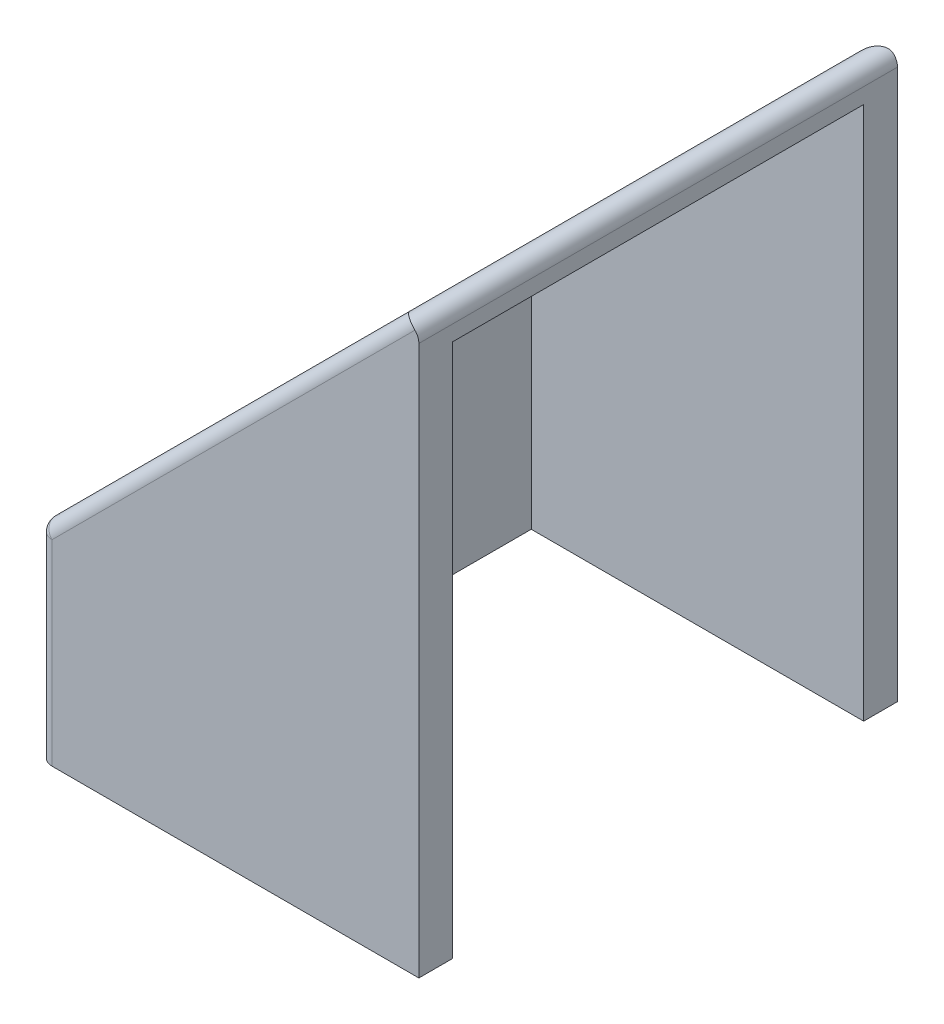
ISO-10303-21;
HEADER;
FILE_DESCRIPTION(('STEP AP214'),'2;1');
FILE_NAME('part.step','',(''),(''),'','','');
FILE_SCHEMA(('AUTOMOTIVE_DESIGN { 1 0 10303 214 1 1 1 1 }'));
ENDSEC;
DATA;
#1=APPLICATION_CONTEXT('core data for automotive mechanical design processes');
#2=APPLICATION_PROTOCOL_DEFINITION('international standard','automotive_design',2000,#1);
#3=PRODUCT_CONTEXT('',#1,'mechanical');
#4=PRODUCT('Part','Part','',(#3));
#5=PRODUCT_RELATED_PRODUCT_CATEGORY('part','',(#4));
#6=PRODUCT_DEFINITION_FORMATION('','',#4);
#7=PRODUCT_DEFINITION_CONTEXT('part definition',#1,'design');
#8=PRODUCT_DEFINITION('design','',#6,#7);
#9=PRODUCT_DEFINITION_SHAPE('','',#8);
#10=(LENGTH_UNIT() NAMED_UNIT(*) SI_UNIT(.MILLI.,.METRE.));
#11=(NAMED_UNIT(*) PLANE_ANGLE_UNIT() SI_UNIT($,.RADIAN.));
#12=(NAMED_UNIT(*) SI_UNIT($,.STERADIAN.) SOLID_ANGLE_UNIT());
#13=UNCERTAINTY_MEASURE_WITH_UNIT(LENGTH_MEASURE(1.E-05),#10,'distance_accuracy_value','');
#14=(GEOMETRIC_REPRESENTATION_CONTEXT(3) GLOBAL_UNCERTAINTY_ASSIGNED_CONTEXT((#13)) GLOBAL_UNIT_ASSIGNED_CONTEXT((#10,
#11,#12)) REPRESENTATION_CONTEXT('',''));
#15=CARTESIAN_POINT('',(0.,0.,0.));
#16=DIRECTION('',(0.,0.,1.));
#17=DIRECTION('',(1.,0.,0.));
#18=AXIS2_PLACEMENT_3D('',#15,#16,#17);
#19=CARTESIAN_POINT('',(17.9605122421382,17.9605122421384,22.606));
#20=DIRECTION('',(-1.,0.,0.));
#21=DIRECTION('',(0.,-1.,0.));
#22=AXIS2_PLACEMENT_3D('',#19,#20,#21);
#23=PLANE('',#22);
#24=DIRECTION('',(0.,1.,0.));
#25=VECTOR('',#24,1.);
#26=CARTESIAN_POINT('',(17.9605122421382,17.9605122421384,0.));
#27=LINE('',#26,#25);
#28=CARTESIAN_POINT('',(17.9605122421382,-9.525,0.));
#29=VERTEX_POINT('',#28);
#30=CARTESIAN_POINT('',(17.9605122421382,16.4274866300315,0.));
#31=VERTEX_POINT('',#30);
#32=EDGE_CURVE('E141',#29,#31,#27,.T.);
#33=ORIENTED_EDGE('',*,*,#32,.T.);
#34=DIRECTION('',(0.,0.,-1.));
#35=VECTOR('',#34,1.);
#36=CARTESIAN_POINT('',(17.9605122421382,16.4274866300315,22.606));
#37=LINE('',#36,#35);
#38=CARTESIAN_POINT('',(17.9605122421382,16.4274866300315,22.606));
#39=VERTEX_POINT('',#38);
#40=EDGE_CURVE('E12',#31,#39,#37,.F.);
#41=ORIENTED_EDGE('',*,*,#40,.T.);
#42=DIRECTION('',(0.,1.,0.));
#43=VECTOR('',#42,1.);
#44=CARTESIAN_POINT('',(17.9605122421382,17.9605122421384,22.606));
#45=LINE('',#44,#43);
#46=CARTESIAN_POINT('',(17.9605122421382,-9.525,22.606));
#47=VERTEX_POINT('',#46);
#48=EDGE_CURVE('E131',#47,#39,#45,.T.);
#49=ORIENTED_EDGE('',*,*,#48,.F.);
#50=DIRECTION('',(0.,0.,1.));
#51=VECTOR('',#50,1.);
#52=CARTESIAN_POINT('',(17.9605122421382,-9.525,21.006));
#53=LINE('',#52,#51);
#54=CARTESIAN_POINT('',(17.9605122421382,-9.525,21.006));
#55=VERTEX_POINT('',#54);
#56=EDGE_CURVE('E136',#55,#47,#53,.T.);
#57=ORIENTED_EDGE('',*,*,#56,.F.);
#58=DIRECTION('',(0.,-1.,0.));
#59=VECTOR('',#58,1.);
#60=CARTESIAN_POINT('',(17.9605122421382,16.3605122421384,21.006));
#61=LINE('',#60,#59);
#62=CARTESIAN_POINT('',(17.9605122421382,15.6977705423414,21.006));
#63=VERTEX_POINT('',#62);
#64=EDGE_CURVE('E181',#63,#55,#61,.T.);
#65=ORIENTED_EDGE('',*,*,#64,.F.);
#66=DIRECTION('',(0.,0.,-1.));
#67=VECTOR('',#66,1.);
#68=CARTESIAN_POINT('',(17.9605122421382,15.6977705423414,0.));
#69=LINE('',#68,#67);
#70=CARTESIAN_POINT('',(17.9605122421382,15.6977705423414,1.6));
#71=VERTEX_POINT('',#70);
#72=EDGE_CURVE('E186',#63,#71,#69,.T.);
#73=ORIENTED_EDGE('',*,*,#72,.T.);
#74=DIRECTION('',(0.,1.,0.));
#75=VECTOR('',#74,1.);
#76=CARTESIAN_POINT('',(17.9605122421382,0.,1.6));
#77=LINE('',#76,#75);
#78=CARTESIAN_POINT('',(17.9605122421382,-9.525,1.6));
#79=VERTEX_POINT('',#78);
#80=EDGE_CURVE('E177',#79,#71,#77,.T.);
#81=ORIENTED_EDGE('',*,*,#80,.F.);
#82=DIRECTION('',(0.,0.,1.));
#83=VECTOR('',#82,1.);
#84=CARTESIAN_POINT('',(17.9605122421382,-9.525,0.));
#85=LINE('',#84,#83);
#86=EDGE_CURVE('E164',#29,#79,#85,.T.);
#87=ORIENTED_EDGE('',*,*,#86,.F.);
#88=EDGE_LOOP('',(#33,#41,#49,#57,#65,#73,#81,#87));
#89=FACE_BOUND('',#88,.T.);
#90=ADVANCED_FACE('F36',(#89),#23,.F.);
#91=CARTESIAN_POINT('',(0.,0.,22.606));
#92=DIRECTION('',(0.707106781186551,-0.707106781186543,0.));
#93=DIRECTION('',(0.707106781186543,0.707106781186552,0.));
#94=AXIS2_PLACEMENT_3D('',#91,#92,#93);
#95=PLANE('',#94);
#96=DIRECTION('',(0.,0.,-1.));
#97=VECTOR('',#96,1.);
#98=CARTESIAN_POINT('',(16.8764994360847,16.8764994360849,22.606));
#99=LINE('',#98,#97);
#100=CARTESIAN_POINT('',(16.8764994360847,16.8764994360849,21.971));
#101=VERTEX_POINT('',#100);
#102=CARTESIAN_POINT('',(16.8764994360847,16.8764994360849,0.635));
#103=VERTEX_POINT('',#102);
#104=EDGE_CURVE('E217',#101,#103,#99,.T.);
#105=ORIENTED_EDGE('',*,*,#104,.T.);
#106=DIRECTION('',(-0.707106781186543,-0.707106781186552,0.));
#107=VECTOR('',#106,1.);
#108=CARTESIAN_POINT('',(0.,0.,0.635));
#109=LINE('',#108,#107);
#110=CARTESIAN_POINT('',(0.18598719394654,0.185987193946542,0.635));
#111=VERTEX_POINT('',#110);
#112=EDGE_CURVE('E45',#103,#111,#109,.T.);
#113=ORIENTED_EDGE('',*,*,#112,.T.);
#114=DIRECTION('',(0.,0.,-1.));
#115=VECTOR('',#114,1.);
#116=CARTESIAN_POINT('',(0.18598719394654,0.185987193946542,22.606));
#117=LINE('',#116,#115);
#118=CARTESIAN_POINT('',(0.18598719394654,0.185987193946542,21.971));
#119=VERTEX_POINT('',#118);
#120=EDGE_CURVE('E215',#111,#119,#117,.F.);
#121=ORIENTED_EDGE('',*,*,#120,.T.);
#122=DIRECTION('',(-0.707106781186543,-0.707106781186552,0.));
#123=VECTOR('',#122,1.);
#124=CARTESIAN_POINT('',(17.9605122421382,17.9605122421384,21.971));
#125=LINE('',#124,#123);
#126=EDGE_CURVE('E213',#119,#101,#125,.F.);
#127=ORIENTED_EDGE('',*,*,#126,.T.);
#128=EDGE_LOOP('',(#105,#113,#121,#127));
#129=FACE_BOUND('',#128,.T.);
#130=ADVANCED_FACE('F293',(#129),#95,.F.);
#131=CARTESIAN_POINT('',(0.,0.,22.606));
#132=DIRECTION('',(0.,0.,1.));
#133=DIRECTION('',(1.,0.,0.));
#134=AXIS2_PLACEMENT_3D('',#131,#132,#133);
#135=PLANE('',#134);
#136=DIRECTION('',(-0.707106781186543,-0.707106781186552,0.));
#137=VECTOR('',#136,1.);
#138=CARTESIAN_POINT('',(0.44901280605346,-0.449012806053455,22.606));
#139=LINE('',#138,#137);
#140=CARTESIAN_POINT('',(17.7745250481917,16.8764994360849,22.606));
#141=VERTEX_POINT('',#140);
#142=CARTESIAN_POINT('',(0.635,-0.263025612106913,22.606));
#143=VERTEX_POINT('',#142);
#144=EDGE_CURVE('E208',#141,#143,#139,.T.);
#145=ORIENTED_EDGE('',*,*,#144,.T.);
#146=DIRECTION('',(0.,1.,0.));
#147=VECTOR('',#146,1.);
#148=CARTESIAN_POINT('',(0.635,-9.525,22.606));
#149=LINE('',#148,#147);
#150=CARTESIAN_POINT('',(0.635,-9.525,22.606));
#151=VERTEX_POINT('',#150);
#152=EDGE_CURVE('E147',#143,#151,#149,.F.);
#153=ORIENTED_EDGE('',*,*,#152,.T.);
#154=DIRECTION('',(-1.,0.,0.));
#155=VECTOR('',#154,1.);
#156=CARTESIAN_POINT('',(17.9605122421382,-9.525,22.606));
#157=LINE('',#156,#155);
#158=EDGE_CURVE('E144',#47,#151,#157,.T.);
#159=ORIENTED_EDGE('',*,*,#158,.F.);
#160=ORIENTED_EDGE('',*,*,#48,.T.);
#161=CARTESIAN_POINT('',(17.3255122421382,16.4274866300315,22.606));
#162=DIRECTION('',(0.,0.,1.));
#163=DIRECTION('',(1.,0.,0.));
#164=AXIS2_PLACEMENT_3D('',#161,#162,#163);
#165=CIRCLE('',#164,0.635);
#166=EDGE_CURVE('E210',#39,#141,#165,.T.);
#167=ORIENTED_EDGE('',*,*,#166,.T.);
#168=EDGE_LOOP('',(#145,#153,#159,#160,#167));
#169=FACE_BOUND('',#168,.T.);
#170=ADVANCED_FACE('F145',(#169),#135,.T.);
#171=CARTESIAN_POINT('',(0.,0.,0.));
#172=DIRECTION('',(0.,0.,1.));
#173=DIRECTION('',(1.,0.,0.));
#174=AXIS2_PLACEMENT_3D('',#171,#172,#173);
#175=PLANE('',#174);
#176=DIRECTION('',(1.,0.,0.));
#177=VECTOR('',#176,1.);
#178=CARTESIAN_POINT('',(0.,-9.525,0.));
#179=LINE('',#178,#177);
#180=CARTESIAN_POINT('',(0.635,-9.525,0.));
#181=VERTEX_POINT('',#180);
#182=EDGE_CURVE('E162',#181,#29,#179,.T.);
#183=ORIENTED_EDGE('',*,*,#182,.F.);
#184=DIRECTION('',(0.,1.,0.));
#185=VECTOR('',#184,1.);
#186=CARTESIAN_POINT('',(0.635,0.,0.));
#187=LINE('',#186,#185);
#188=CARTESIAN_POINT('',(0.635,-0.263025612106911,0.));
#189=VERTEX_POINT('',#188);
#190=EDGE_CURVE('E195',#181,#189,#187,.T.);
#191=ORIENTED_EDGE('',*,*,#190,.T.);
#192=DIRECTION('',(-0.707106781186543,-0.707106781186552,0.));
#193=VECTOR('',#192,1.);
#194=CARTESIAN_POINT('',(0.44901280605346,-0.449012806053455,0.));
#195=LINE('',#194,#193);
#196=CARTESIAN_POINT('',(17.7745250481917,16.8764994360849,0.));
#197=VERTEX_POINT('',#196);
#198=EDGE_CURVE('E140',#189,#197,#195,.F.);
#199=ORIENTED_EDGE('',*,*,#198,.T.);
#200=CARTESIAN_POINT('',(17.3255122421382,16.4274866300315,0.));
#201=DIRECTION('',(0.,0.,1.));
#202=DIRECTION('',(1.,0.,0.));
#203=AXIS2_PLACEMENT_3D('',#200,#201,#202);
#204=CIRCLE('',#203,0.635);
#205=EDGE_CURVE('E193',#197,#31,#204,.F.);
#206=ORIENTED_EDGE('',*,*,#205,.T.);
#207=ORIENTED_EDGE('',*,*,#32,.F.);
#208=EDGE_LOOP('',(#183,#191,#199,#206,#207));
#209=FACE_BOUND('',#208,.T.);
#210=ADVANCED_FACE('F262',(#209),#175,.F.);
#211=CARTESIAN_POINT('',(-21.7961021093821,16.3605122421384,21.006));
#212=DIRECTION('',(0.,0.,1.));
#213=DIRECTION('',(1.,0.,0.));
#214=AXIS2_PLACEMENT_3D('',#211,#212,#213);
#215=PLANE('',#214);
#216=DIRECTION('',(0.707106781186543,0.707106781186552,0.));
#217=VECTOR('',#216,1.);
#218=CARTESIAN_POINT('',(-1.58642408372326,-3.84916578352025,21.006));
#219=LINE('',#218,#217);
#220=CARTESIAN_POINT('',(2.26274169979693,0.,21.006));
#221=VERTEX_POINT('',#220);
#222=EDGE_CURVE('E178',#221,#63,#219,.T.);
#223=ORIENTED_EDGE('',*,*,#222,.T.);
#224=ORIENTED_EDGE('',*,*,#64,.T.);
#225=DIRECTION('',(1.,0.,0.));
#226=VECTOR('',#225,1.);
#227=CARTESIAN_POINT('',(2.26274169979693,-9.525,21.006));
#228=LINE('',#227,#226);
#229=CARTESIAN_POINT('',(2.26274169979693,-9.525,21.006));
#230=VERTEX_POINT('',#229);
#231=EDGE_CURVE('E156',#230,#55,#228,.T.);
#232=ORIENTED_EDGE('',*,*,#231,.F.);
#233=DIRECTION('',(0.,1.,0.));
#234=VECTOR('',#233,1.);
#235=CARTESIAN_POINT('',(2.26274169979693,-9.525,21.006));
#236=LINE('',#235,#234);
#237=EDGE_CURVE('E172',#230,#221,#236,.T.);
#238=ORIENTED_EDGE('',*,*,#237,.T.);
#239=EDGE_LOOP('',(#223,#224,#232,#238));
#240=FACE_BOUND('',#239,.T.);
#241=ADVANCED_FACE('F279',(#240),#215,.F.);
#242=CARTESIAN_POINT('',(-21.7961021093821,0.,1.6));
#243=DIRECTION('',(0.,0.,-1.));
#244=DIRECTION('',(0.,1.,0.));
#245=AXIS2_PLACEMENT_3D('',#242,#243,#244);
#246=PLANE('',#245);
#247=DIRECTION('',(-0.707106781186543,-0.707106781186552,0.));
#248=VECTOR('',#247,1.);
#249=CARTESIAN_POINT('',(-9.76668020479247,-12.0294219045895,1.6));
#250=LINE('',#249,#248);
#251=CARTESIAN_POINT('',(2.26274169979693,0.,1.6));
#252=VERTEX_POINT('',#251);
#253=EDGE_CURVE('E183',#71,#252,#250,.T.);
#254=ORIENTED_EDGE('',*,*,#253,.T.);
#255=DIRECTION('',(0.,1.,0.));
#256=VECTOR('',#255,1.);
#257=CARTESIAN_POINT('',(2.26274169979693,-9.525,1.6));
#258=LINE('',#257,#256);
#259=CARTESIAN_POINT('',(2.26274169979693,-9.525,1.6));
#260=VERTEX_POINT('',#259);
#261=EDGE_CURVE('E175',#260,#252,#258,.T.);
#262=ORIENTED_EDGE('',*,*,#261,.F.);
#263=DIRECTION('',(-1.,0.,0.));
#264=VECTOR('',#263,1.);
#265=CARTESIAN_POINT('',(17.9605122421382,-9.525,1.6));
#266=LINE('',#265,#264);
#267=EDGE_CURVE('E167',#79,#260,#266,.T.);
#268=ORIENTED_EDGE('',*,*,#267,.F.);
#269=ORIENTED_EDGE('',*,*,#80,.T.);
#270=EDGE_LOOP('',(#254,#262,#268,#269));
#271=FACE_BOUND('',#270,.T.);
#272=ADVANCED_FACE('F270',(#271),#246,.F.);
#273=CARTESIAN_POINT('',(1.13137084989848,-1.13137084989847,22.606));
#274=DIRECTION('',(0.707106781186551,-0.707106781186543,0.));
#275=DIRECTION('',(0.707106781186543,0.707106781186552,0.));
#276=AXIS2_PLACEMENT_3D('',#273,#274,#275);
#277=PLANE('',#276);
#278=ORIENTED_EDGE('',*,*,#253,.F.);
#279=ORIENTED_EDGE('',*,*,#72,.F.);
#280=ORIENTED_EDGE('',*,*,#222,.F.);
#281=DIRECTION('',(0.,0.,1.));
#282=VECTOR('',#281,1.);
#283=CARTESIAN_POINT('',(2.26274169979693,0.,21.006));
#284=LINE('',#283,#282);
#285=EDGE_CURVE('E180',#252,#221,#284,.T.);
#286=ORIENTED_EDGE('',*,*,#285,.F.);
#287=EDGE_LOOP('',(#278,#279,#280,#286));
#288=FACE_BOUND('',#287,.T.);
#289=ADVANCED_FACE('F282',(#288),#277,.T.);
#290=CARTESIAN_POINT('',(0.,-9.525,22.606));
#291=DIRECTION('',(1.,0.,0.));
#292=DIRECTION('',(0.,1.,0.));
#293=AXIS2_PLACEMENT_3D('',#290,#291,#292);
#294=PLANE('',#293);
#295=DIRECTION('',(0.,0.,-1.));
#296=VECTOR('',#295,1.);
#297=CARTESIAN_POINT('',(0.,-0.263025612106912,22.606));
#298=LINE('',#297,#296);
#299=CARTESIAN_POINT('',(0.,-0.263025612106912,21.971));
#300=VERTEX_POINT('',#299);
#301=CARTESIAN_POINT('',(0.,-0.263025612106912,0.635));
#302=VERTEX_POINT('',#301);
#303=EDGE_CURVE('E198',#300,#302,#298,.T.);
#304=ORIENTED_EDGE('',*,*,#303,.T.);
#305=DIRECTION('',(0.,1.,0.));
#306=VECTOR('',#305,1.);
#307=CARTESIAN_POINT('',(0.,-9.525,0.635));
#308=LINE('',#307,#306);
#309=CARTESIAN_POINT('',(0.,-9.525,0.635000000000007));
#310=VERTEX_POINT('',#309);
#311=EDGE_CURVE('E202',#302,#310,#308,.F.);
#312=ORIENTED_EDGE('',*,*,#311,.T.);
#313=DIRECTION('',(0.,0.,-1.));
#314=VECTOR('',#313,1.);
#315=CARTESIAN_POINT('',(0.,-9.525,22.606));
#316=LINE('',#315,#314);
#317=CARTESIAN_POINT('',(0.,-9.525,21.971));
#318=VERTEX_POINT('',#317);
#319=EDGE_CURVE('E150',#318,#310,#316,.T.);
#320=ORIENTED_EDGE('',*,*,#319,.F.);
#321=DIRECTION('',(0.,1.,0.));
#322=VECTOR('',#321,1.);
#323=CARTESIAN_POINT('',(0.,0.,21.971));
#324=LINE('',#323,#322);
#325=EDGE_CURVE('E200',#318,#300,#324,.T.);
#326=ORIENTED_EDGE('',*,*,#325,.T.);
#327=EDGE_LOOP('',(#304,#312,#320,#326));
#328=FACE_BOUND('',#327,.T.);
#329=ADVANCED_FACE('F250',(#328),#294,.F.);
#330=CARTESIAN_POINT('',(2.26274169979693,-9.525,1.6));
#331=DIRECTION('',(-1.,0.,0.));
#332=DIRECTION('',(0.,0.,1.));
#333=AXIS2_PLACEMENT_3D('',#330,#331,#332);
#334=PLANE('',#333);
#335=ORIENTED_EDGE('',*,*,#285,.T.);
#336=ORIENTED_EDGE('',*,*,#237,.F.);
#337=DIRECTION('',(0.,0.,1.));
#338=VECTOR('',#337,1.);
#339=CARTESIAN_POINT('',(2.26274169979693,-9.525,1.6));
#340=LINE('',#339,#338);
#341=EDGE_CURVE('E169',#260,#230,#340,.T.);
#342=ORIENTED_EDGE('',*,*,#341,.F.);
#343=ORIENTED_EDGE('',*,*,#261,.T.);
#344=EDGE_LOOP('',(#335,#336,#342,#343));
#345=FACE_BOUND('',#344,.T.);
#346=ADVANCED_FACE('F276',(#345),#334,.F.);
#347=CARTESIAN_POINT('',(0.,-9.525,0.));
#348=DIRECTION('',(0.,-1.,0.));
#349=DIRECTION('',(1.,0.,0.));
#350=AXIS2_PLACEMENT_3D('',#347,#348,#349);
#351=PLANE('',#350);
#352=ORIENTED_EDGE('',*,*,#319,.T.);
#353=CARTESIAN_POINT('',(0.635,-9.525,0.635));
#354=DIRECTION('',(0.,-1.,0.));
#355=DIRECTION('',(1.,0.,0.));
#356=AXIS2_PLACEMENT_3D('',#353,#354,#355);
#357=CIRCLE('',#356,0.635);
#358=EDGE_CURVE('E206',#310,#181,#357,.T.);
#359=ORIENTED_EDGE('',*,*,#358,.T.);
#360=ORIENTED_EDGE('',*,*,#182,.T.);
#361=ORIENTED_EDGE('',*,*,#86,.T.);
#362=ORIENTED_EDGE('',*,*,#267,.T.);
#363=ORIENTED_EDGE('',*,*,#341,.T.);
#364=ORIENTED_EDGE('',*,*,#231,.T.);
#365=ORIENTED_EDGE('',*,*,#56,.T.);
#366=ORIENTED_EDGE('',*,*,#158,.T.);
#367=CARTESIAN_POINT('',(0.635,-9.525,21.971));
#368=DIRECTION('',(0.,-1.,0.));
#369=DIRECTION('',(1.,0.,0.));
#370=AXIS2_PLACEMENT_3D('',#367,#368,#369);
#371=CIRCLE('',#370,0.635);
#372=EDGE_CURVE('E204',#151,#318,#371,.T.);
#373=ORIENTED_EDGE('',*,*,#372,.T.);
#374=EDGE_LOOP('',(#352,#359,#360,#361,#362,#363,#364,#365,#366,#373));
#375=FACE_BOUND('',#374,.T.);
#376=ADVANCED_FACE('F154',(#375),#351,.T.);
#377=CARTESIAN_POINT('',(0.44901280605346,-0.449012806053455,21.971));
#378=DIRECTION('',(0.707106781186543,0.707106781186552,0.));
#379=DIRECTION('',(-0.707106781186552,0.707106781186543,0.));
#380=AXIS2_PLACEMENT_3D('',#377,#378,#379);
#381=CYLINDRICAL_SURFACE('',#380,0.635);
#382=CARTESIAN_POINT('',(0.635,-0.263025612106913,21.971));
#383=DIRECTION('',(-0.707106781186544,-0.707106781186551,0.));
#384=DIRECTION('',(0.707106781186551,-0.707106781186544,0.));
#385=AXIS2_PLACEMENT_3D('',#382,#383,#384);
#386=CIRCLE('',#385,0.635);
#387=EDGE_CURVE('E159',#143,#119,#386,.T.);
#388=ORIENTED_EDGE('',*,*,#387,.F.);
#389=ORIENTED_EDGE('',*,*,#144,.F.);
#390=CARTESIAN_POINT('',(17.3255122421382,16.4274866300315,21.971));
#391=DIRECTION('',(0.499999999999997,0.500000000000003,-0.707106781186547));
#392=DIRECTION('',(0.499999999999997,0.500000000000003,0.707106781186547));
#393=AXIS2_PLACEMENT_3D('',#390,#391,#392);
#394=ELLIPSE('',#393,0.898025612106915,0.635);
#395=EDGE_CURVE('E40',#101,#141,#394,.T.);
#396=ORIENTED_EDGE('',*,*,#395,.F.);
#397=ORIENTED_EDGE('',*,*,#126,.F.);
#398=EDGE_LOOP('',(#388,#389,#396,#397));
#399=FACE_BOUND('',#398,.T.);
#400=ADVANCED_FACE('F38',(#399),#381,.T.);
#401=CARTESIAN_POINT('',(0.635,-9.525,21.971));
#402=DIRECTION('',(0.,-1.,0.));
#403=DIRECTION('',(1.,0.,0.));
#404=AXIS2_PLACEMENT_3D('',#401,#402,#403);
#405=CYLINDRICAL_SURFACE('',#404,0.635);
#406=ORIENTED_EDGE('',*,*,#372,.F.);
#407=ORIENTED_EDGE('',*,*,#152,.F.);
#408=CARTESIAN_POINT('',(0.635,-0.263025612106912,21.971));
#409=DIRECTION('',(0.,1.,0.));
#410=DIRECTION('',(0.,0.,1.));
#411=AXIS2_PLACEMENT_3D('',#408,#409,#410);
#412=CIRCLE('',#411,0.635);
#413=EDGE_CURVE('E233',#300,#143,#412,.T.);
#414=ORIENTED_EDGE('',*,*,#413,.F.);
#415=ORIENTED_EDGE('',*,*,#325,.F.);
#416=EDGE_LOOP('',(#406,#407,#414,#415));
#417=FACE_BOUND('',#416,.T.);
#418=ADVANCED_FACE('F254',(#417),#405,.T.);
#419=CARTESIAN_POINT('',(17.3255122421382,16.4274866300315,22.606));
#420=DIRECTION('',(0.,0.,-1.));
#421=DIRECTION('',(-1.,0.,0.));
#422=AXIS2_PLACEMENT_3D('',#419,#420,#421);
#423=CYLINDRICAL_SURFACE('',#422,0.635);
#424=ORIENTED_EDGE('',*,*,#40,.F.);
#425=ORIENTED_EDGE('',*,*,#205,.F.);
#426=CARTESIAN_POINT('',(17.3255122421382,16.4274866300315,0.635));
#427=DIRECTION('',(-0.499999999999997,-0.500000000000003,-0.707106781186547));
#428=DIRECTION('',(-0.499999999999997,-0.500000000000003,0.707106781186547));
#429=AXIS2_PLACEMENT_3D('',#426,#427,#428);
#430=ELLIPSE('',#429,0.898025612106915,0.635);
#431=EDGE_CURVE('E231',#103,#197,#430,.T.);
#432=ORIENTED_EDGE('',*,*,#431,.F.);
#433=ORIENTED_EDGE('',*,*,#104,.F.);
#434=ORIENTED_EDGE('',*,*,#395,.T.);
#435=ORIENTED_EDGE('',*,*,#166,.F.);
#436=EDGE_LOOP('',(#424,#425,#432,#433,#434,#435));
#437=FACE_BOUND('',#436,.T.);
#438=ADVANCED_FACE('F314',(#437),#423,.T.);
#439=CARTESIAN_POINT('',(0.635,-0.263025612106913,21.971));
#440=DIRECTION('',(0.,0.,1.));
#441=DIRECTION('',(1.,0.,0.));
#442=AXIS2_PLACEMENT_3D('',#439,#440,#441);
#443=SPHERICAL_SURFACE('',#442,0.635);
#444=ORIENTED_EDGE('',*,*,#413,.T.);
#445=ORIENTED_EDGE('',*,*,#387,.T.);
#446=CARTESIAN_POINT('',(0.635000000000001,-0.263025612106913,21.971));
#447=DIRECTION('',(0.,0.,1.));
#448=DIRECTION('',(1.,0.,0.));
#449=AXIS2_PLACEMENT_3D('',#446,#447,#448);
#450=CIRCLE('',#449,0.635);
#451=EDGE_CURVE('E228',#300,#119,#450,.F.);
#452=ORIENTED_EDGE('',*,*,#451,.F.);
#453=EDGE_LOOP('',(#444,#445,#452));
#454=FACE_BOUND('',#453,.T.);
#455=ADVANCED_FACE('F239',(#454),#443,.T.);
#456=CARTESIAN_POINT('',(0.44901280605346,-0.449012806053455,0.635));
#457=DIRECTION('',(-0.707106781186543,-0.707106781186552,0.));
#458=DIRECTION('',(0.707106781186552,-0.707106781186543,0.));
#459=AXIS2_PLACEMENT_3D('',#456,#457,#458);
#460=CYLINDRICAL_SURFACE('',#459,0.635);
#461=ORIENTED_EDGE('',*,*,#431,.T.);
#462=ORIENTED_EDGE('',*,*,#198,.F.);
#463=CARTESIAN_POINT('',(0.635000000000001,-0.263025612106913,0.635));
#464=DIRECTION('',(-0.707106781186543,-0.707106781186552,0.));
#465=DIRECTION('',(0.707106781186552,-0.707106781186543,0.));
#466=AXIS2_PLACEMENT_3D('',#463,#464,#465);
#467=CIRCLE('',#466,0.635);
#468=EDGE_CURVE('E225',#111,#189,#467,.T.);
#469=ORIENTED_EDGE('',*,*,#468,.F.);
#470=ORIENTED_EDGE('',*,*,#112,.F.);
#471=EDGE_LOOP('',(#461,#462,#469,#470));
#472=FACE_BOUND('',#471,.T.);
#473=ADVANCED_FACE('F309',(#472),#460,.T.);
#474=CARTESIAN_POINT('',(0.635,-0.263025612106912,22.606));
#475=DIRECTION('',(0.,0.,-1.));
#476=DIRECTION('',(-1.,0.,0.));
#477=AXIS2_PLACEMENT_3D('',#474,#475,#476);
#478=CYLINDRICAL_SURFACE('',#477,0.635);
#479=ORIENTED_EDGE('',*,*,#451,.T.);
#480=ORIENTED_EDGE('',*,*,#120,.F.);
#481=CARTESIAN_POINT('',(0.635,-0.263025612106912,0.635));
#482=DIRECTION('',(0.,0.,-1.));
#483=DIRECTION('',(0.,1.,0.));
#484=AXIS2_PLACEMENT_3D('',#481,#482,#483);
#485=CIRCLE('',#484,0.635);
#486=EDGE_CURVE('E222',#302,#111,#485,.T.);
#487=ORIENTED_EDGE('',*,*,#486,.F.);
#488=ORIENTED_EDGE('',*,*,#303,.F.);
#489=EDGE_LOOP('',(#479,#480,#487,#488));
#490=FACE_BOUND('',#489,.T.);
#491=ADVANCED_FACE('F246',(#490),#478,.T.);
#492=CARTESIAN_POINT('',(0.635,-0.263025612106913,0.635));
#493=DIRECTION('',(0.,0.,1.));
#494=DIRECTION('',(1.,0.,0.));
#495=AXIS2_PLACEMENT_3D('',#492,#493,#494);
#496=SPHERICAL_SURFACE('',#495,0.635);
#497=ORIENTED_EDGE('',*,*,#486,.T.);
#498=ORIENTED_EDGE('',*,*,#468,.T.);
#499=CARTESIAN_POINT('',(0.635,-0.263025612106911,0.635));
#500=DIRECTION('',(0.,1.,0.));
#501=DIRECTION('',(-1.,0.,0.));
#502=AXIS2_PLACEMENT_3D('',#499,#500,#501);
#503=CIRCLE('',#502,0.635);
#504=EDGE_CURVE('E220',#302,#189,#503,.F.);
#505=ORIENTED_EDGE('',*,*,#504,.F.);
#506=EDGE_LOOP('',(#497,#498,#505));
#507=FACE_BOUND('',#506,.T.);
#508=ADVANCED_FACE('F303',(#507),#496,.T.);
#509=CARTESIAN_POINT('',(0.635,0.,0.635));
#510=DIRECTION('',(0.,1.,0.));
#511=DIRECTION('',(-1.,0.,0.));
#512=AXIS2_PLACEMENT_3D('',#509,#510,#511);
#513=CYLINDRICAL_SURFACE('',#512,0.635);
#514=ORIENTED_EDGE('',*,*,#358,.F.);
#515=ORIENTED_EDGE('',*,*,#311,.F.);
#516=ORIENTED_EDGE('',*,*,#504,.T.);
#517=ORIENTED_EDGE('',*,*,#190,.F.);
#518=EDGE_LOOP('',(#514,#515,#516,#517));
#519=FACE_BOUND('',#518,.T.);
#520=ADVANCED_FACE('F259',(#519),#513,.T.);
#521=CLOSED_SHELL('',(#90,#130,#170,#210,#241,#272,#289,#329,#346,#376,#400,#418,#438,#455,#473,
#491,#508,#520));
#522=MANIFOLD_SOLID_BREP('B2',#521);
#523=ADVANCED_BREP_SHAPE_REPRESENTATION('',(#18,#522),#14);
#524=SHAPE_DEFINITION_REPRESENTATION(#9,#523);
ENDSEC;
END-ISO-10303-21;
